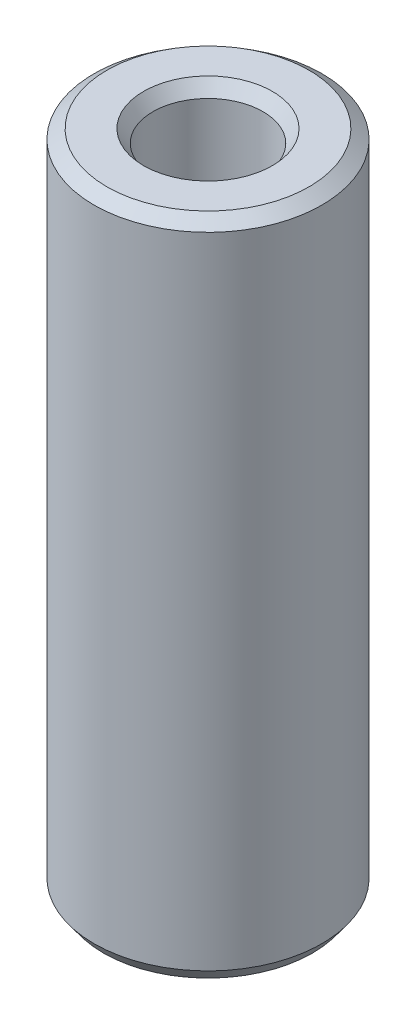
ISO-10303-21;
HEADER;
FILE_DESCRIPTION(('STEP AP214'),'2;1');
FILE_NAME('part.step','',(''),(''),'','','');
FILE_SCHEMA(('AUTOMOTIVE_DESIGN { 1 0 10303 214 1 1 1 1 }'));
ENDSEC;
DATA;
#1=APPLICATION_CONTEXT('core data for automotive mechanical design processes');
#2=APPLICATION_PROTOCOL_DEFINITION('international standard','automotive_design',2000,#1);
#3=PRODUCT_CONTEXT('',#1,'mechanical');
#4=PRODUCT('Part','Part','',(#3));
#5=PRODUCT_RELATED_PRODUCT_CATEGORY('part','',(#4));
#6=PRODUCT_DEFINITION_FORMATION('','',#4);
#7=PRODUCT_DEFINITION_CONTEXT('part definition',#1,'design');
#8=PRODUCT_DEFINITION('design','',#6,#7);
#9=PRODUCT_DEFINITION_SHAPE('','',#8);
#10=(LENGTH_UNIT() NAMED_UNIT(*) SI_UNIT(.MILLI.,.METRE.));
#11=(NAMED_UNIT(*) PLANE_ANGLE_UNIT() SI_UNIT($,.RADIAN.));
#12=(NAMED_UNIT(*) SI_UNIT($,.STERADIAN.) SOLID_ANGLE_UNIT());
#13=UNCERTAINTY_MEASURE_WITH_UNIT(LENGTH_MEASURE(1.E-05),#10,'distance_accuracy_value','');
#14=(GEOMETRIC_REPRESENTATION_CONTEXT(3) GLOBAL_UNCERTAINTY_ASSIGNED_CONTEXT((#13)) GLOBAL_UNIT_ASSIGNED_CONTEXT((#10,
#11,#12)) REPRESENTATION_CONTEXT('',''));
#15=CARTESIAN_POINT('',(0.,0.,0.));
#16=DIRECTION('',(0.,0.,1.));
#17=DIRECTION('',(1.,0.,0.));
#18=AXIS2_PLACEMENT_3D('',#15,#16,#17);
#19=CARTESIAN_POINT('',(0.,246.93845146929,0.));
#20=DIRECTION('',(0.,-1.,0.));
#21=DIRECTION('',(0.,0.,-1.));
#22=AXIS2_PLACEMENT_3D('',#19,#20,#21);
#23=CYLINDRICAL_SURFACE('',#22,42.5);
#24=CARTESIAN_POINT('',(0.,4.79494172974257,0.));
#25=DIRECTION('',(0.,1.,0.));
#26=DIRECTION('',(0.,0.,1.));
#27=AXIS2_PLACEMENT_3D('',#24,#25,#26);
#28=CIRCLE('',#27,42.5);
#29=CARTESIAN_POINT('',(0.,4.79494172974257,42.5));
#30=VERTEX_POINT('',#29);
#31=EDGE_CURVE('E10',#30,#30,#28,.T.);
#32=ORIENTED_EDGE('',*,*,#31,.T.);
#33=EDGE_LOOP('',(#32));
#34=FACE_BOUND('',#33,.T.);
#35=CARTESIAN_POINT('',(0.,243.433615659055,0.));
#36=DIRECTION('',(0.,1.,0.));
#37=DIRECTION('',(0.,0.,1.));
#38=AXIS2_PLACEMENT_3D('',#35,#36,#37);
#39=CIRCLE('',#38,42.5);
#40=CARTESIAN_POINT('',(0.,243.433615659055,42.5));
#41=VERTEX_POINT('',#40);
#42=EDGE_CURVE('E50',#41,#41,#39,.F.);
#43=ORIENTED_EDGE('',*,*,#42,.T.);
#44=EDGE_LOOP('',(#43));
#45=FACE_BOUND('',#44,.T.);
#46=ADVANCED_FACE('F39',(#34,#45),#23,.T.);
#47=CARTESIAN_POINT('',(0.,246.93845146929,0.));
#48=DIRECTION('',(0.,1.,0.));
#49=DIRECTION('',(0.,0.,1.));
#50=AXIS2_PLACEMENT_3D('',#47,#48,#49);
#51=PLANE('',#50);
#52=CARTESIAN_POINT('',(0.,246.93845146929,0.));
#53=DIRECTION('',(0.,1.,0.));
#54=DIRECTION('',(0.,0.,1.));
#55=AXIS2_PLACEMENT_3D('',#52,#53,#54);
#56=CIRCLE('',#55,24.0260867992902);
#57=CARTESIAN_POINT('',(0.,246.93845146929,24.0260867992902));
#58=VERTEX_POINT('',#57);
#59=EDGE_CURVE('E58',#58,#58,#56,.F.);
#60=ORIENTED_EDGE('',*,*,#59,.T.);
#61=EDGE_LOOP('',(#60));
#62=FACE_BOUND('',#61,.T.);
#63=CARTESIAN_POINT('',(0.,246.93845146929,0.));
#64=DIRECTION('',(0.,1.,0.));
#65=DIRECTION('',(0.,0.,1.));
#66=AXIS2_PLACEMENT_3D('',#63,#64,#65);
#67=CIRCLE('',#66,37.7050582702575);
#68=CARTESIAN_POINT('',(0.,246.93845146929,37.7050582702575));
#69=VERTEX_POINT('',#68);
#70=EDGE_CURVE('E61',#69,#69,#67,.T.);
#71=ORIENTED_EDGE('',*,*,#70,.T.);
#72=EDGE_LOOP('',(#71));
#73=FACE_BOUND('',#72,.T.);
#74=ADVANCED_FACE('F88',(#62,#73),#51,.T.);
#75=CARTESIAN_POINT('',(0.,0.,0.));
#76=DIRECTION('',(0.,1.,0.));
#77=DIRECTION('',(0.,0.,1.));
#78=AXIS2_PLACEMENT_3D('',#75,#76,#77);
#79=PLANE('',#78);
#80=CARTESIAN_POINT('',(0.,0.,0.));
#81=DIRECTION('',(0.,1.,0.));
#82=DIRECTION('',(0.,0.,1.));
#83=AXIS2_PLACEMENT_3D('',#80,#81,#82);
#84=CIRCLE('',#83,25.3161927187976);
#85=CARTESIAN_POINT('',(0.,0.,25.3161927187976));
#86=VERTEX_POINT('',#85);
#87=EDGE_CURVE('E51',#86,#86,#84,.T.);
#88=ORIENTED_EDGE('',*,*,#87,.T.);
#89=EDGE_LOOP('',(#88));
#90=FACE_BOUND('',#89,.T.);
#91=CARTESIAN_POINT('',(0.,0.,0.));
#92=DIRECTION('',(0.,1.,0.));
#93=DIRECTION('',(0.,0.,1.));
#94=AXIS2_PLACEMENT_3D('',#91,#92,#93);
#95=CIRCLE('',#94,38.9951641897648);
#96=CARTESIAN_POINT('',(0.,0.,38.9951641897648));
#97=VERTEX_POINT('',#96);
#98=EDGE_CURVE('E54',#97,#97,#95,.F.);
#99=ORIENTED_EDGE('',*,*,#98,.T.);
#100=EDGE_LOOP('',(#99));
#101=FACE_BOUND('',#100,.T.);
#102=ADVANCED_FACE('F83',(#90,#101),#79,.F.);
#103=CARTESIAN_POINT('',(0.,246.93845146929,0.));
#104=DIRECTION('',(0.,-1.,0.));
#105=DIRECTION('',(0.,0.,-1.));
#106=AXIS2_PLACEMENT_3D('',#103,#104,#105);
#107=CYLINDRICAL_SURFACE('',#106,20.5212509890551);
#108=CARTESIAN_POINT('',(0.,242.143509739547,0.));
#109=DIRECTION('',(0.,1.,0.));
#110=DIRECTION('',(0.,0.,1.));
#111=AXIS2_PLACEMENT_3D('',#108,#109,#110);
#112=CIRCLE('',#111,20.5212509890551);
#113=CARTESIAN_POINT('',(0.,242.143509739547,20.5212509890551));
#114=VERTEX_POINT('',#113);
#115=EDGE_CURVE('E67',#114,#114,#112,.T.);
#116=ORIENTED_EDGE('',*,*,#115,.T.);
#117=EDGE_LOOP('',(#116));
#118=FACE_BOUND('',#117,.T.);
#119=CARTESIAN_POINT('',(0.,3.50483581023517,0.));
#120=DIRECTION('',(0.,1.,0.));
#121=DIRECTION('',(0.,0.,1.));
#122=AXIS2_PLACEMENT_3D('',#119,#120,#121);
#123=CIRCLE('',#122,20.5212509890551);
#124=CARTESIAN_POINT('',(0.,3.50483581023517,20.5212509890551));
#125=VERTEX_POINT('',#124);
#126=EDGE_CURVE('E69',#125,#125,#123,.F.);
#127=ORIENTED_EDGE('',*,*,#126,.T.);
#128=EDGE_LOOP('',(#127));
#129=FACE_BOUND('',#128,.T.);
#130=ADVANCED_FACE('F71',(#118,#129),#107,.F.);
#131=CARTESIAN_POINT('',(0.,242.143509739547,0.));
#132=DIRECTION('',(0.,1.,0.));
#133=DIRECTION('',(0.,0.,1.));
#134=AXIS2_PLACEMENT_3D('',#131,#132,#133);
#135=CONICAL_SURFACE('',#134,20.5212509890551,0.6311935679544);
#136=ORIENTED_EDGE('',*,*,#59,.F.);
#137=EDGE_LOOP('',(#136));
#138=FACE_BOUND('',#137,.T.);
#139=ORIENTED_EDGE('',*,*,#115,.F.);
#140=EDGE_LOOP('',(#139));
#141=FACE_BOUND('',#140,.T.);
#142=ADVANCED_FACE('F77',(#138,#141),#135,.F.);
#143=CARTESIAN_POINT('',(0.,0.,0.));
#144=DIRECTION('',(0.,-1.,0.));
#145=DIRECTION('',(0.,0.,-1.));
#146=AXIS2_PLACEMENT_3D('',#143,#144,#145);
#147=CONICAL_SURFACE('',#146,25.3161927187976,0.939602758840487);
#148=ORIENTED_EDGE('',*,*,#126,.F.);
#149=EDGE_LOOP('',(#148));
#150=FACE_BOUND('',#149,.T.);
#151=ORIENTED_EDGE('',*,*,#87,.F.);
#152=EDGE_LOOP('',(#151));
#153=FACE_BOUND('',#152,.T.);
#154=ADVANCED_FACE('F73',(#150,#153),#147,.F.);
#155=CARTESIAN_POINT('',(0.,4.79494172974257,0.));
#156=DIRECTION('',(0.,1.,0.));
#157=DIRECTION('',(0.,0.,1.));
#158=AXIS2_PLACEMENT_3D('',#155,#156,#157);
#159=CONICAL_SURFACE('',#158,42.5,0.631193567954405);
#160=ORIENTED_EDGE('',*,*,#98,.F.);
#161=EDGE_LOOP('',(#160));
#162=FACE_BOUND('',#161,.T.);
#163=ORIENTED_EDGE('',*,*,#31,.F.);
#164=EDGE_LOOP('',(#163));
#165=FACE_BOUND('',#164,.T.);
#166=ADVANCED_FACE('F76',(#162,#165),#159,.T.);
#167=CARTESIAN_POINT('',(0.,246.93845146929,0.));
#168=DIRECTION('',(0.,-1.,0.));
#169=DIRECTION('',(0.,0.,-1.));
#170=AXIS2_PLACEMENT_3D('',#167,#168,#169);
#171=CONICAL_SURFACE('',#170,37.7050582702575,0.93960275884049);
#172=ORIENTED_EDGE('',*,*,#42,.F.);
#173=EDGE_LOOP('',(#172));
#174=FACE_BOUND('',#173,.T.);
#175=ORIENTED_EDGE('',*,*,#70,.F.);
#176=EDGE_LOOP('',(#175));
#177=FACE_BOUND('',#176,.T.);
#178=ADVANCED_FACE('F45',(#174,#177),#171,.T.);
#179=CLOSED_SHELL('',(#46,#74,#102,#130,#142,#154,#166,#178));
#180=MANIFOLD_SOLID_BREP('B2',#179);
#181=ADVANCED_BREP_SHAPE_REPRESENTATION('',(#18,#180),#14);
#182=SHAPE_DEFINITION_REPRESENTATION(#9,#181);
ENDSEC;
END-ISO-10303-21;
